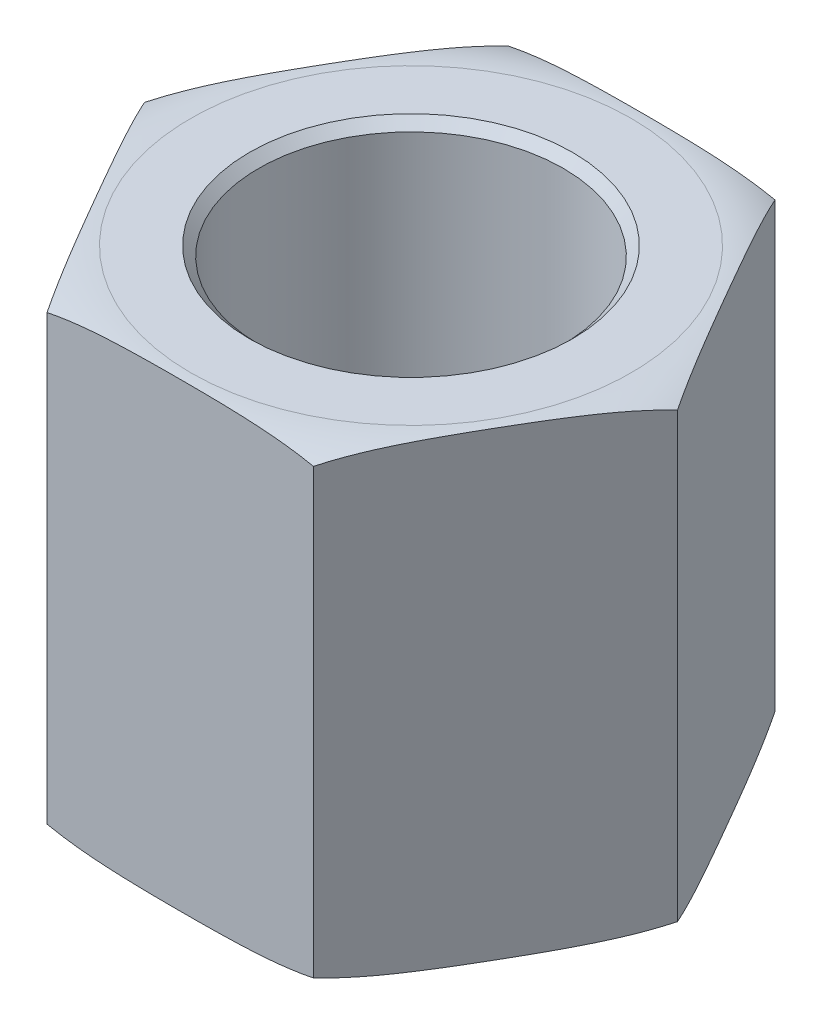
ISO-10303-21;
HEADER;
FILE_DESCRIPTION(('STEP AP214'),'2;1');
FILE_NAME('part.step','',(''),(''),'','','');
FILE_SCHEMA(('AUTOMOTIVE_DESIGN { 1 0 10303 214 1 1 1 1 }'));
ENDSEC;
DATA;
#1=APPLICATION_CONTEXT('core data for automotive mechanical design processes');
#2=APPLICATION_PROTOCOL_DEFINITION('international standard','automotive_design',2000,#1);
#3=PRODUCT_CONTEXT('',#1,'mechanical');
#4=PRODUCT('Part','Part','',(#3));
#5=PRODUCT_RELATED_PRODUCT_CATEGORY('part','',(#4));
#6=PRODUCT_DEFINITION_FORMATION('','',#4);
#7=PRODUCT_DEFINITION_CONTEXT('part definition',#1,'design');
#8=PRODUCT_DEFINITION('design','',#6,#7);
#9=PRODUCT_DEFINITION_SHAPE('','',#8);
#10=(LENGTH_UNIT() NAMED_UNIT(*) SI_UNIT(.MILLI.,.METRE.));
#11=(NAMED_UNIT(*) PLANE_ANGLE_UNIT() SI_UNIT($,.RADIAN.));
#12=(NAMED_UNIT(*) SI_UNIT($,.STERADIAN.) SOLID_ANGLE_UNIT());
#13=UNCERTAINTY_MEASURE_WITH_UNIT(LENGTH_MEASURE(1.E-05),#10,'distance_accuracy_value','');
#14=(GEOMETRIC_REPRESENTATION_CONTEXT(3) GLOBAL_UNCERTAINTY_ASSIGNED_CONTEXT((#13)) GLOBAL_UNIT_ASSIGNED_CONTEXT((#10,
#11,#12)) REPRESENTATION_CONTEXT('',''));
#15=CARTESIAN_POINT('',(0.,0.,0.));
#16=DIRECTION('',(0.,0.,1.));
#17=DIRECTION('',(1.,0.,0.));
#18=AXIS2_PLACEMENT_3D('',#15,#16,#17);
#19=CARTESIAN_POINT('',(3.66617420935412,3.175,0.));
#20=DIRECTION('',(-0.866025403784439,0.,0.5));
#21=DIRECTION('',(0.5,0.,0.866025403784439));
#22=AXIS2_PLACEMENT_3D('',#19,#20,#21);
#23=PLANE('',#22);
#24=CARTESIAN_POINT('',(3.66617420935412,3.048,0.));
#25=CARTESIAN_POINT('',(3.63753042799203,3.05993202468709,-0.0496124846400275));
#26=CARTESIAN_POINT('',(3.60875945805376,3.07055614694223,-0.0994452663561579));
#27=CARTESIAN_POINT('',(3.5510445941875,3.08952869380446,-0.199410342924434));
#28=CARTESIAN_POINT('',(3.52210079717004,3.09787829008084,-0.249542469922637));
#29=CARTESIAN_POINT('',(3.43520914920621,3.12001015084215,-0.400043218949386));
#30=CARTESIAN_POINT('',(3.37708055050429,3.13092253839952,-0.500724905273884));
#31=CARTESIAN_POINT('',(3.26070078255249,3.1475474670846,-0.702300576339481));
#32=CARTESIAN_POINT('',(3.20244972255356,3.15326351393611,-0.803194371852366));
#33=CARTESIAN_POINT('',(3.08586365366197,3.16154325238668,-1.00512736662734));
#34=CARTESIAN_POINT('',(3.02752861562773,3.1641051045623,-1.1061666163641));
#35=CARTESIAN_POINT('',(2.9113821383228,3.1674800878033,-1.30733821617637));
#36=CARTESIAN_POINT('',(2.85357078573452,3.16830898530758,-1.40747041611356));
#37=CARTESIAN_POINT('',(2.73795502274299,3.16890235146376,-1.60772279177073));
#38=CARTESIAN_POINT('',(2.68015061252641,3.16866697200316,-1.7078429671674));
#39=CARTESIAN_POINT('',(2.5645271384304,3.16693398748164,-1.90810869884931));
#40=CARTESIAN_POINT('',(2.50670807591217,3.16543597123025,-2.0082542527769));
#41=CARTESIAN_POINT('',(2.39109525560101,3.16017531674577,-2.20850153156215));
#42=CARTESIAN_POINT('',(2.33330149587797,3.15641290136093,-2.30860325976289));
#43=CARTESIAN_POINT('',(2.23849359853911,3.14698899303816,-2.47281535491257));
#44=CARTESIAN_POINT('',(2.20145192539194,3.14249057663767,-2.53697341480081));
#45=CARTESIAN_POINT('',(2.12747060706784,3.13130148199487,-2.66511281694909));
#46=CARTESIAN_POINT('',(2.09053091530161,3.12461207209161,-2.72909423990413));
#47=CARTESIAN_POINT('',(2.01669860633929,3.10839780386583,-2.85697555026699));
#48=CARTESIAN_POINT('',(1.97980639337021,3.09886525006224,-2.92087473753309));
#49=CARTESIAN_POINT('',(1.90623831426152,3.07626291445617,-3.04829838836459));
#50=CARTESIAN_POINT('',(1.86956287153406,3.06318767878213,-3.11182211855863));
#51=CARTESIAN_POINT('',(1.83308710467706,3.048,-3.175));
#52=B_SPLINE_CURVE_WITH_KNOTS('',3,(#24,#25,#26,#27,#28,#29,#30,#31,#32,#33,#34,#35,#36,#37,#38,
#39,#40,#41,#42,#43,#44,#45,#46,#47,#48,#49,#50,#51),.UNSPECIFIED.,.F.,.F.,(4,2,2,2,2,2,2,2,2,2,
2,2,2,4),(0.,0.175509467388221,0.350928353443246,0.701031261588486,1.05089779629355,
1.40096826525494,1.74783967758032,2.09466158796882,2.44159648808704,2.78849725058545,
3.01113198199941,3.23363806003512,3.45675194236246,3.68021127402553),.UNSPECIFIED.);
#53=CARTESIAN_POINT('',(3.66617420935412,3.048,0.));
#54=VERTEX_POINT('',#53);
#55=CARTESIAN_POINT('',(1.83308710467706,3.048,-3.175));
#56=VERTEX_POINT('',#55);
#57=EDGE_CURVE('E107',#54,#56,#52,.T.);
#58=ORIENTED_EDGE('',*,*,#57,.F.);
#59=DIRECTION('',(0.,1.,0.));
#60=VECTOR('',#59,1.);
#61=CARTESIAN_POINT('',(3.66617420935412,3.175,0.));
#62=LINE('',#61,#60);
#63=CARTESIAN_POINT('',(3.66617420935412,-3.048,0.));
#64=VERTEX_POINT('',#63);
#65=EDGE_CURVE('E80',#54,#64,#62,.F.);
#66=ORIENTED_EDGE('',*,*,#65,.T.);
#67=CARTESIAN_POINT('',(1.83308710467705,-3.048,-3.17500000000001));
#68=CARTESIAN_POINT('',(1.86173088603914,-3.05993202468708,-3.12538751535998));
#69=CARTESIAN_POINT('',(1.89050185597742,-3.07055614694223,-3.07555473364385));
#70=CARTESIAN_POINT('',(1.94821671984367,-3.08952869380445,-2.97558965707557));
#71=CARTESIAN_POINT('',(1.97716051686113,-3.09787829008084,-2.92545753007737));
#72=CARTESIAN_POINT('',(2.06405216482496,-3.12001015084215,-2.77495678105063));
#73=CARTESIAN_POINT('',(2.12218076352688,-3.13092253839952,-2.67427509472613));
#74=CARTESIAN_POINT('',(2.23856053147868,-3.1475474670846,-2.47269942366053));
#75=CARTESIAN_POINT('',(2.2968115914776,-3.15326351393611,-2.37180562814765));
#76=CARTESIAN_POINT('',(2.4133976603692,-3.16154325238667,-2.16987263337268));
#77=CARTESIAN_POINT('',(2.47173269840344,-3.1641051045623,-2.06883338363591));
#78=CARTESIAN_POINT('',(2.58787917570836,-3.1674800878033,-1.86766178382365));
#79=CARTESIAN_POINT('',(2.64569052829664,-3.16830898530758,-1.76752958388646));
#80=CARTESIAN_POINT('',(2.76130629128817,-3.16890235146376,-1.56727720822929));
#81=CARTESIAN_POINT('',(2.81911070150475,-3.16866697200316,-1.46715703283263));
#82=CARTESIAN_POINT('',(2.93473417560076,-3.16693398748165,-1.26689130115071));
#83=CARTESIAN_POINT('',(2.99255323811899,-3.16543597123025,-1.16674574722313));
#84=CARTESIAN_POINT('',(3.10816605843015,-3.16017531674577,-0.966498468437875));
#85=CARTESIAN_POINT('',(3.16595981815319,-3.15641290136093,-0.866396740237143));
#86=CARTESIAN_POINT('',(3.26076771549205,-3.14698899303816,-0.702184645087457));
#87=CARTESIAN_POINT('',(3.29780938863922,-3.14249057663768,-0.638026585199212));
#88=CARTESIAN_POINT('',(3.37179070696332,-3.13130148199487,-0.509887183050936));
#89=CARTESIAN_POINT('',(3.40873039872955,-3.12461207209161,-0.445905760095884));
#90=CARTESIAN_POINT('',(3.48256270769188,-3.10839780386584,-0.318024449733019));
#91=CARTESIAN_POINT('',(3.51945492066096,-3.09886525006225,-0.254125262466917));
#92=CARTESIAN_POINT('',(3.59302299976965,-3.07626291445617,-0.126701611635416));
#93=CARTESIAN_POINT('',(3.62969844249711,-3.06318767878214,-0.0631778814413746));
#94=CARTESIAN_POINT('',(3.66617420935412,-3.048,0.));
#95=B_SPLINE_CURVE_WITH_KNOTS('',3,(#67,#68,#69,#70,#71,#72,#73,#74,#75,#76,#77,#78,#79,#80,#81,
#82,#83,#84,#85,#86,#87,#88,#89,#90,#91,#92,#93,#94),.UNSPECIFIED.,.F.,.F.,(4,2,2,2,2,2,2,2,2,2,
2,2,2,4),(0.,0.175509467388219,0.350928353443241,0.701031261588478,1.05089779629354,
1.40096826525492,1.7478396775803,2.0946615879688,2.44159648808701,2.78849725058542,
3.01113198199939,3.23363806003511,3.45675194236245,3.68021127402553),.UNSPECIFIED.);
#96=CARTESIAN_POINT('',(1.83308710467705,-3.048,-3.175));
#97=VERTEX_POINT('',#96);
#98=EDGE_CURVE('E97',#97,#64,#95,.T.);
#99=ORIENTED_EDGE('',*,*,#98,.F.);
#100=DIRECTION('',(0.,1.,0.));
#101=VECTOR('',#100,1.);
#102=CARTESIAN_POINT('',(1.83308710467705,3.175,-3.175));
#103=LINE('',#102,#101);
#104=EDGE_CURVE('E111',#97,#56,#103,.T.);
#105=ORIENTED_EDGE('',*,*,#104,.T.);
#106=EDGE_LOOP('',(#58,#66,#99,#105));
#107=FACE_BOUND('',#106,.T.);
#108=ADVANCED_FACE('F17',(#107),#23,.F.);
#109=CARTESIAN_POINT('',(1.83308710467706,3.175,3.17499999999999));
#110=DIRECTION('',(-0.866025403784439,0.,-0.5));
#111=DIRECTION('',(-0.5,0.,0.866025403784439));
#112=AXIS2_PLACEMENT_3D('',#109,#110,#111);
#113=PLANE('',#112);
#114=CARTESIAN_POINT('',(1.83308710467706,3.048,3.17499999999999));
#115=CARTESIAN_POINT('',(1.86173088603915,3.05993202468709,3.12538751535996));
#116=CARTESIAN_POINT('',(1.89050185597743,3.07055614694223,3.07555473364383));
#117=CARTESIAN_POINT('',(1.94821671984368,3.08952869380446,2.97558965707556));
#118=CARTESIAN_POINT('',(1.97716051686114,3.09787829008084,2.92545753007736));
#119=CARTESIAN_POINT('',(2.06405216482498,3.12001015084215,2.77495678105061));
#120=CARTESIAN_POINT('',(2.12218076352689,3.13092253839952,2.67427509472611));
#121=CARTESIAN_POINT('',(2.23856053147869,3.1475474670846,2.47269942366051));
#122=CARTESIAN_POINT('',(2.29681159147762,3.15326351393611,2.37180562814762));
#123=CARTESIAN_POINT('',(2.41339766036922,3.16154325238668,2.16987263337265));
#124=CARTESIAN_POINT('',(2.47173269840346,3.1641051045623,2.06883338363588));
#125=CARTESIAN_POINT('',(2.58787917570838,3.1674800878033,1.86766178382361));
#126=CARTESIAN_POINT('',(2.64569052829666,3.16830898530758,1.76752958388643));
#127=CARTESIAN_POINT('',(2.76130629128819,3.16890235146376,1.56727720822926));
#128=CARTESIAN_POINT('',(2.81911070150477,3.16866697200316,1.46715703283259));
#129=CARTESIAN_POINT('',(2.93473417560078,3.16693398748164,1.26689130115067));
#130=CARTESIAN_POINT('',(2.99255323811902,3.16543597123025,1.16674574722309));
#131=CARTESIAN_POINT('',(3.10816605843018,3.16017531674577,0.966498468437834));
#132=CARTESIAN_POINT('',(3.16595981815322,3.15641290136093,0.866396740237101));
#133=CARTESIAN_POINT('',(3.26076771549208,3.14698899303816,0.702184645087417));
#134=CARTESIAN_POINT('',(3.29780938863924,3.14249057663767,0.638026585199176));
#135=CARTESIAN_POINT('',(3.37179070696334,3.13130148199487,0.509887183050908));
#136=CARTESIAN_POINT('',(3.40873039872957,3.12461207209161,0.44590576009586));
#137=CARTESIAN_POINT('',(3.48256270769189,3.10839780386583,0.318024449733003));
#138=CARTESIAN_POINT('',(3.51945492066097,3.09886525006224,0.254125262466906));
#139=CARTESIAN_POINT('',(3.59302299976965,3.07626291445617,0.126701611635412));
#140=CARTESIAN_POINT('',(3.62969844249711,3.06318767878213,0.0631778814413752));
#141=CARTESIAN_POINT('',(3.66617420935412,3.048,0.));
#142=B_SPLINE_CURVE_WITH_KNOTS('',3,(#114,#115,#116,#117,#118,#119,#120,#121,#122,#123,#124,
#125,#126,#127,#128,#129,#130,#131,#132,#133,#134,#135,#136,#137,#138,#139,#140,#141),
.UNSPECIFIED.,.F.,.F.,(4,2,2,2,2,2,2,2,2,2,2,2,2,4),(0.,0.175509467388221,0.350928353443245,
0.701031261588487,1.05089779629355,1.40096826525494,1.74783967758032,2.09466158796883,
2.44159648808704,2.78849725058546,3.01113198199941,3.23363806003511,3.45675194236244,
3.68021127402551),.UNSPECIFIED.);
#143=CARTESIAN_POINT('',(1.83308710467706,3.048,3.17499999999999));
#144=VERTEX_POINT('',#143);
#145=EDGE_CURVE('E22',#144,#54,#142,.T.);
#146=ORIENTED_EDGE('',*,*,#145,.F.);
#147=DIRECTION('',(0.,1.,0.));
#148=VECTOR('',#147,1.);
#149=CARTESIAN_POINT('',(1.83308710467706,3.175,3.17499999999999));
#150=LINE('',#149,#148);
#151=CARTESIAN_POINT('',(1.83308710467706,-3.048,3.17499999999999));
#152=VERTEX_POINT('',#151);
#153=EDGE_CURVE('E100',#144,#152,#150,.F.);
#154=ORIENTED_EDGE('',*,*,#153,.T.);
#155=CARTESIAN_POINT('',(3.66617420935412,-3.048,0.));
#156=CARTESIAN_POINT('',(3.63753042799203,-3.05993202468709,0.0496124846400327));
#157=CARTESIAN_POINT('',(3.60875945805375,-3.07055614694223,0.0994452663561634));
#158=CARTESIAN_POINT('',(3.5510445941875,-3.08952869380446,0.199410342924441));
#159=CARTESIAN_POINT('',(3.52210079717004,-3.09787829008084,0.249542469922644));
#160=CARTESIAN_POINT('',(3.4352091492062,-3.12001015084215,0.400043218949395));
#161=CARTESIAN_POINT('',(3.37708055050429,-3.13092253839952,0.500724905273894));
#162=CARTESIAN_POINT('',(3.26070078255248,-3.1475474670846,0.702300576339492));
#163=CARTESIAN_POINT('',(3.20244972255356,-3.15326351393611,0.803194371852379));
#164=CARTESIAN_POINT('',(3.08586365366196,-3.16154325238668,1.00512736662735));
#165=CARTESIAN_POINT('',(3.02752861562772,-3.1641051045623,1.10616661636412));
#166=CARTESIAN_POINT('',(2.91138213832279,-3.1674800878033,1.30733821617639));
#167=CARTESIAN_POINT('',(2.85357078573451,-3.16830898530758,1.40747041611358));
#168=CARTESIAN_POINT('',(2.73795502274298,-3.16890235146376,1.60772279177075));
#169=CARTESIAN_POINT('',(2.6801506125264,-3.16866697200316,1.70784296716742));
#170=CARTESIAN_POINT('',(2.56452713843039,-3.16693398748164,1.90810869884934));
#171=CARTESIAN_POINT('',(2.50670807591215,-3.16543597123025,2.00825425277692));
#172=CARTESIAN_POINT('',(2.39109525560099,-3.16017531674577,2.20850153156218));
#173=CARTESIAN_POINT('',(2.33330149587795,-3.15641290136093,2.30860325976292));
#174=CARTESIAN_POINT('',(2.23849359853909,-3.14698899303816,2.4728153549126));
#175=CARTESIAN_POINT('',(2.20145192539193,-3.14249057663767,2.53697341480084));
#176=CARTESIAN_POINT('',(2.12747060706783,-3.13130148199487,2.6651128169491));
#177=CARTESIAN_POINT('',(2.0905309153016,-3.1246120720916,2.72909423990415));
#178=CARTESIAN_POINT('',(2.01669860633929,-3.10839780386583,2.856975550267));
#179=CARTESIAN_POINT('',(1.97980639337021,-3.09886525006224,2.9208747375331));
#180=CARTESIAN_POINT('',(1.90623831426152,-3.07626291445617,3.04829838836459));
#181=CARTESIAN_POINT('',(1.86956287153407,-3.06318767878213,3.11182211855862));
#182=CARTESIAN_POINT('',(1.83308710467706,-3.048,3.17499999999999));
#183=B_SPLINE_CURVE_WITH_KNOTS('',3,(#155,#156,#157,#158,#159,#160,#161,#162,#163,#164,#165,
#166,#167,#168,#169,#170,#171,#172,#173,#174,#175,#176,#177,#178,#179,#180,#181,#182),
.UNSPECIFIED.,.F.,.F.,(4,2,2,2,2,2,2,2,2,2,2,2,2,4),(0.,0.175509467388222,0.350928353443248,
0.701031261588493,1.05089779629356,1.40096826525495,1.74783967758034,2.09466158796885,
2.44159648808707,2.78849725058548,3.01113198199943,3.23363806003512,3.45675194236245,
3.68021127402551),.UNSPECIFIED.);
#184=EDGE_CURVE('E205',#64,#152,#183,.T.);
#185=ORIENTED_EDGE('',*,*,#184,.F.);
#186=ORIENTED_EDGE('',*,*,#65,.F.);
#187=EDGE_LOOP('',(#146,#154,#185,#186));
#188=FACE_BOUND('',#187,.T.);
#189=ADVANCED_FACE('F106',(#188),#113,.F.);
#190=CARTESIAN_POINT('',(-1.83308710467707,3.175,3.175));
#191=DIRECTION('',(0.,0.,-1.));
#192=DIRECTION('',(-1.,0.,0.));
#193=AXIS2_PLACEMENT_3D('',#190,#191,#192);
#194=PLANE('',#193);
#195=ORIENTED_EDGE('',*,*,#153,.F.);
#196=CARTESIAN_POINT('',(-1.83308710467707,3.048,3.175));
#197=CARTESIAN_POINT('',(-1.75760871054776,3.06371230122365,3.175));
#198=CARTESIAN_POINT('',(-1.68170571468658,3.0771647800808,3.175));
#199=CARTESIAN_POINT('',(-1.52939807527773,3.10030486470105,3.175));
#200=CARTESIAN_POINT('',(-1.45299400110163,3.10999617502722,3.175));
#201=CARTESIAN_POINT('',(-1.30011823209764,3.12637135267139,3.175));
#202=CARTESIAN_POINT('',(-1.22364747610196,3.13306442247852,3.175));
#203=CARTESIAN_POINT('',(-1.07052459410173,3.14417241699752,3.175));
#204=CARTESIAN_POINT('',(-0.993872424115957,3.14858671655425,3.175));
#205=CARTESIAN_POINT('',(-0.840856910195846,3.15572419802799,3.175));
#206=CARTESIAN_POINT('',(-0.764493913329282,3.15845527367792,3.175));
#207=CARTESIAN_POINT('',(-0.611734616938516,3.16275632258003,3.175));
#208=CARTESIAN_POINT('',(-0.535338316331409,3.16432625473883,3.175));
#209=CARTESIAN_POINT('',(-0.38245423122642,3.16668247076568,3.175));
#210=CARTESIAN_POINT('',(-0.305966435115039,3.16746792759644,3.175));
#211=CARTESIAN_POINT('',(-0.152985759387013,3.16848841069005,3.175));
#212=CARTESIAN_POINT('',(-0.0764928796935065,3.16872342414921,3.175));
#213=CARTESIAN_POINT('',(0.0764928796935058,3.16872342414921,3.175));
#214=CARTESIAN_POINT('',(0.152985759387012,3.16848841069005,3.17499999999999));
#215=CARTESIAN_POINT('',(0.305966435115038,3.16746792759644,3.17499999999999));
#216=CARTESIAN_POINT('',(0.382454231226419,3.16668247076568,3.17499999999999));
#217=CARTESIAN_POINT('',(0.535338316331408,3.16432625473883,3.17499999999999));
#218=CARTESIAN_POINT('',(0.611734616938514,3.16275632258003,3.17499999999999));
#219=CARTESIAN_POINT('',(0.76449391332928,3.15845527367792,3.17499999999999));
#220=CARTESIAN_POINT('',(0.840856910195844,3.15572419802799,3.17499999999999));
#221=CARTESIAN_POINT('',(0.993872424115954,3.14858671655425,3.17499999999999));
#222=CARTESIAN_POINT('',(1.07052459410172,3.14417241699752,3.17499999999999));
#223=CARTESIAN_POINT('',(1.22364747610196,3.13306442247852,3.17499999999999));
#224=CARTESIAN_POINT('',(1.30011823209763,3.12637135267139,3.17499999999999));
#225=CARTESIAN_POINT('',(1.45299400110163,3.10999617502722,3.17499999999999));
#226=CARTESIAN_POINT('',(1.52939807527773,3.10030486470105,3.17499999999999));
#227=CARTESIAN_POINT('',(1.68170571468658,3.07716478008081,3.17499999999999));
#228=CARTESIAN_POINT('',(1.75760871054776,3.06371230122365,3.17499999999999));
#229=CARTESIAN_POINT('',(1.83308710467706,3.048,3.17499999999999));
#230=B_SPLINE_CURVE_WITH_KNOTS('',3,(#196,#197,#198,#199,#200,#201,#202,#203,#204,#205,#206,
#207,#208,#209,#210,#211,#212,#213,#214,#215,#216,#217,#218,#219,#220,#221,#222,#223,#224,#225,
#226,#227,#228,#229),.UNSPECIFIED.,.F.,.F.,(4,2,2,2,2,2,2,2,2,2,2,2,2,2,2,2,4),(0.,
0.23119079437731,0.46215329593589,0.692401964780504,0.922713766248053,1.15193709952408,
1.3811685447265,1.61064140410055,1.84011960111017,2.06959779811978,2.29907065749383,
2.52830210269625,2.75752543597228,2.98783723743982,3.21808590628444,3.44904840784302,
3.68023920222033),.UNSPECIFIED.);
#231=CARTESIAN_POINT('',(-1.83308710467707,3.048,3.175));
#232=VERTEX_POINT('',#231);
#233=EDGE_CURVE('E86',#232,#144,#230,.T.);
#234=ORIENTED_EDGE('',*,*,#233,.F.);
#235=DIRECTION('',(0.,1.,0.));
#236=VECTOR('',#235,1.);
#237=CARTESIAN_POINT('',(-1.83308710467707,3.175,3.175));
#238=LINE('',#237,#236);
#239=CARTESIAN_POINT('',(-1.83308710467707,-3.048,3.175));
#240=VERTEX_POINT('',#239);
#241=EDGE_CURVE('E104',#232,#240,#238,.F.);
#242=ORIENTED_EDGE('',*,*,#241,.T.);
#243=CARTESIAN_POINT('',(1.83308710467706,-3.048,3.17499999999999));
#244=CARTESIAN_POINT('',(1.75760871054776,-3.06371230122365,3.17499999999999));
#245=CARTESIAN_POINT('',(1.68170571468658,-3.07716478008081,3.17499999999999));
#246=CARTESIAN_POINT('',(1.52939807527773,-3.10030486470105,3.17499999999999));
#247=CARTESIAN_POINT('',(1.45299400110163,-3.10999617502722,3.17499999999999));
#248=CARTESIAN_POINT('',(1.30011823209763,-3.12637135267139,3.17499999999999));
#249=CARTESIAN_POINT('',(1.22364747610196,-3.13306442247852,3.17499999999999));
#250=CARTESIAN_POINT('',(1.07052459410172,-3.14417241699752,3.17499999999999));
#251=CARTESIAN_POINT('',(0.993872424115954,-3.14858671655425,3.17499999999999));
#252=CARTESIAN_POINT('',(0.840856910195844,-3.15572419802799,3.17499999999999));
#253=CARTESIAN_POINT('',(0.76449391332928,-3.15845527367792,3.17499999999999));
#254=CARTESIAN_POINT('',(0.611734616938515,-3.16275632258003,3.17499999999999));
#255=CARTESIAN_POINT('',(0.535338316331408,-3.16432625473883,3.17499999999999));
#256=CARTESIAN_POINT('',(0.382454231226419,-3.16668247076568,3.17499999999999));
#257=CARTESIAN_POINT('',(0.305966435115038,-3.16746792759644,3.17499999999999));
#258=CARTESIAN_POINT('',(0.152985759387012,-3.16848841069005,3.17499999999999));
#259=CARTESIAN_POINT('',(0.0764928796935062,-3.16872342414921,3.175));
#260=CARTESIAN_POINT('',(-0.076492879693506,-3.16872342414921,3.175));
#261=CARTESIAN_POINT('',(-0.152985759387012,-3.16848841069005,3.175));
#262=CARTESIAN_POINT('',(-0.305966435115038,-3.16746792759644,3.175));
#263=CARTESIAN_POINT('',(-0.382454231226419,-3.16668247076568,3.175));
#264=CARTESIAN_POINT('',(-0.535338316331408,-3.16432625473883,3.175));
#265=CARTESIAN_POINT('',(-0.611734616938515,-3.16275632258003,3.175));
#266=CARTESIAN_POINT('',(-0.76449391332928,-3.15845527367792,3.175));
#267=CARTESIAN_POINT('',(-0.840856910195844,-3.15572419802798,3.175));
#268=CARTESIAN_POINT('',(-0.993872424115954,-3.14858671655425,3.175));
#269=CARTESIAN_POINT('',(-1.07052459410172,-3.14417241699752,3.175));
#270=CARTESIAN_POINT('',(-1.22364747610196,-3.13306442247852,3.175));
#271=CARTESIAN_POINT('',(-1.30011823209763,-3.12637135267139,3.175));
#272=CARTESIAN_POINT('',(-1.45299400110163,-3.10999617502722,3.175));
#273=CARTESIAN_POINT('',(-1.52939807527773,-3.10030486470105,3.175));
#274=CARTESIAN_POINT('',(-1.68170571468658,-3.07716478008081,3.175));
#275=CARTESIAN_POINT('',(-1.75760871054776,-3.06371230122365,3.175));
#276=CARTESIAN_POINT('',(-1.83308710467706,-3.048,3.175));
#277=B_SPLINE_CURVE_WITH_KNOTS('',3,(#243,#244,#245,#246,#247,#248,#249,#250,#251,#252,#253,
#254,#255,#256,#257,#258,#259,#260,#261,#262,#263,#264,#265,#266,#267,#268,#269,#270,#271,#272,
#273,#274,#275,#276),.UNSPECIFIED.,.F.,.F.,(4,2,2,2,2,2,2,2,2,2,2,2,2,2,2,2,4),(0.,
0.231190794377309,0.462153295935889,0.692401964780502,0.92271376624805,1.15193709952407,
1.3811685447265,1.61064140410055,1.84011960111016,2.06959779811977,2.29907065749383,
2.52830210269625,2.75752543597227,2.98783723743982,3.21808590628443,3.44904840784301,
3.68023920222032),.UNSPECIFIED.);
#278=EDGE_CURVE('E102',#152,#240,#277,.T.);
#279=ORIENTED_EDGE('',*,*,#278,.F.);
#280=EDGE_LOOP('',(#195,#234,#242,#279));
#281=FACE_BOUND('',#280,.T.);
#282=ADVANCED_FACE('F101',(#281),#194,.F.);
#283=CARTESIAN_POINT('',(-3.66617420935413,3.175,0.));
#284=DIRECTION('',(0.866025403784439,0.,-0.499999999999999));
#285=DIRECTION('',(-0.499999999999999,0.,-0.866025403784439));
#286=AXIS2_PLACEMENT_3D('',#283,#284,#285);
#287=PLANE('',#286);
#288=CARTESIAN_POINT('',(-3.66617420935412,3.048,0.));
#289=CARTESIAN_POINT('',(-3.63753042799204,3.05993202468708,0.0496124846400254));
#290=CARTESIAN_POINT('',(-3.60875945805376,3.07055614694223,0.0994452663561539));
#291=CARTESIAN_POINT('',(-3.55104459418751,3.08952869380445,0.199410342924427));
#292=CARTESIAN_POINT('',(-3.52210079717005,3.09787829008083,0.249542469922628));
#293=CARTESIAN_POINT('',(-3.43520914920622,3.12001015084215,0.400043218949372));
#294=CARTESIAN_POINT('',(-3.37708055050431,3.13092253839952,0.500724905273867));
#295=CARTESIAN_POINT('',(-3.26070078255251,3.1475474670846,0.702300576339457));
#296=CARTESIAN_POINT('',(-3.20244972255358,3.15326351393611,0.803194371852339));
#297=CARTESIAN_POINT('',(-3.08586365366199,3.16154325238667,1.0051273666273));
#298=CARTESIAN_POINT('',(-3.02752861562775,3.1641051045623,1.10616661636407));
#299=CARTESIAN_POINT('',(-2.91138213832284,3.1674800878033,1.30733821617633));
#300=CARTESIAN_POINT('',(-2.85357078573456,3.16830898530758,1.40747041611351));
#301=CARTESIAN_POINT('',(-2.73795502274303,3.16890235146376,1.60772279177068));
#302=CARTESIAN_POINT('',(-2.68015061252645,3.16866697200316,1.70784296716734));
#303=CARTESIAN_POINT('',(-2.56452713843045,3.16693398748165,1.90810869884925));
#304=CARTESIAN_POINT('',(-2.50670807591221,3.16543597123025,2.00825425277683));
#305=CARTESIAN_POINT('',(-2.39109525560106,3.16017531674577,2.20850153156208));
#306=CARTESIAN_POINT('',(-2.33330149587802,3.15641290136093,2.30860325976281));
#307=CARTESIAN_POINT('',(-2.23849359853916,3.14698899303816,2.4728153549125));
#308=CARTESIAN_POINT('',(-2.20145192539199,3.14249057663768,2.53697341480075));
#309=CARTESIAN_POINT('',(-2.12747060706788,3.13130148199487,2.66511281694903));
#310=CARTESIAN_POINT('',(-2.09053091530165,3.12461207209161,2.72909423990409));
#311=CARTESIAN_POINT('',(-2.01669860633932,3.10839780386584,2.85697555026696));
#312=CARTESIAN_POINT('',(-1.97980639337024,3.09886525006225,2.92087473753306));
#313=CARTESIAN_POINT('',(-1.90623831426154,3.07626291445617,3.04829838836457));
#314=CARTESIAN_POINT('',(-1.86956287153408,3.06318767878213,3.11182211855862));
#315=CARTESIAN_POINT('',(-1.83308710467707,3.048,3.175));
#316=B_SPLINE_CURVE_WITH_KNOTS('',3,(#288,#289,#290,#291,#292,#293,#294,#295,#296,#297,#298,
#299,#300,#301,#302,#303,#304,#305,#306,#307,#308,#309,#310,#311,#312,#313,#314,#315),
.UNSPECIFIED.,.F.,.F.,(4,2,2,2,2,2,2,2,2,2,2,2,2,4),(0.,0.175509467388214,0.350928353443233,
0.701031261588463,1.05089779629351,1.40096826525489,1.74783967758026,2.09466158796875,
2.44159648808696,2.78849725058536,3.01113198199934,3.23363806003507,3.45675194236243,
3.68021127402552),.UNSPECIFIED.);
#317=CARTESIAN_POINT('',(-3.66617420935413,3.048,0.));
#318=VERTEX_POINT('',#317);
#319=EDGE_CURVE('E94',#318,#232,#316,.T.);
#320=ORIENTED_EDGE('',*,*,#319,.F.);
#321=DIRECTION('',(0.,1.,0.));
#322=VECTOR('',#321,1.);
#323=CARTESIAN_POINT('',(-3.66617420935413,3.175,0.));
#324=LINE('',#323,#322);
#325=CARTESIAN_POINT('',(-3.66617420935413,-3.048,0.));
#326=VERTEX_POINT('',#325);
#327=EDGE_CURVE('E118',#318,#326,#324,.F.);
#328=ORIENTED_EDGE('',*,*,#327,.T.);
#329=CARTESIAN_POINT('',(-1.83308710467707,-3.048,3.175));
#330=CARTESIAN_POINT('',(-1.86173088603915,-3.05993202468708,3.12538751535997));
#331=CARTESIAN_POINT('',(-1.89050185597743,-3.07055614694223,3.07555473364384));
#332=CARTESIAN_POINT('',(-1.94821671984368,-3.08952869380445,2.97558965707557));
#333=CARTESIAN_POINT('',(-1.97716051686114,-3.09787829008083,2.92545753007737));
#334=CARTESIAN_POINT('',(-2.06405216482497,-3.12001015084215,2.77495678105062));
#335=CARTESIAN_POINT('',(-2.12218076352689,-3.13092253839952,2.67427509472613));
#336=CARTESIAN_POINT('',(-2.23856053147869,-3.1475474670846,2.47269942366054));
#337=CARTESIAN_POINT('',(-2.29681159147761,-3.15326351393611,2.37180562814765));
#338=CARTESIAN_POINT('',(-2.4133976603692,-3.16154325238667,2.16987263337269));
#339=CARTESIAN_POINT('',(-2.47173269840344,-3.1641051045623,2.06883338363592));
#340=CARTESIAN_POINT('',(-2.58787917570836,-3.1674800878033,1.86766178382366));
#341=CARTESIAN_POINT('',(-2.64569052829664,-3.16830898530758,1.76752958388648));
#342=CARTESIAN_POINT('',(-2.76130629128817,-3.16890235146376,1.56727720822931));
#343=CARTESIAN_POINT('',(-2.81911070150475,-3.16866697200316,1.46715703283264));
#344=CARTESIAN_POINT('',(-2.93473417560076,-3.16693398748165,1.26689130115073));
#345=CARTESIAN_POINT('',(-2.99255323811899,-3.16543597123025,1.16674574722315));
#346=CARTESIAN_POINT('',(-3.10816605843014,-3.16017531674577,0.966498468437898));
#347=CARTESIAN_POINT('',(-3.16595981815318,-3.15641290136093,0.866396740237167));
#348=CARTESIAN_POINT('',(-3.26076771549205,-3.14698899303816,0.70218464508748));
#349=CARTESIAN_POINT('',(-3.29780938863921,-3.14249057663768,0.638026585199233));
#350=CARTESIAN_POINT('',(-3.37179070696332,-3.13130148199487,0.509887183050953));
#351=CARTESIAN_POINT('',(-3.40873039872955,-3.12461207209161,0.4459057600959));
#352=CARTESIAN_POINT('',(-3.48256270769188,-3.10839780386584,0.31802444973303));
#353=CARTESIAN_POINT('',(-3.51945492066096,-3.09886525006224,0.254125262466927));
#354=CARTESIAN_POINT('',(-3.59302299976965,-3.07626291445617,0.126701611635421));
#355=CARTESIAN_POINT('',(-3.62969844249711,-3.06318767878213,0.0631778814413779));
#356=CARTESIAN_POINT('',(-3.66617420935412,-3.048,0.));
#357=B_SPLINE_CURVE_WITH_KNOTS('',3,(#329,#330,#331,#332,#333,#334,#335,#336,#337,#338,#339,
#340,#341,#342,#343,#344,#345,#346,#347,#348,#349,#350,#351,#352,#353,#354,#355,#356),
.UNSPECIFIED.,.F.,.F.,(4,2,2,2,2,2,2,2,2,2,2,2,2,4),(0.,0.175509467388216,0.350928353443237,
0.701031261588469,1.05089779629352,1.4009682652549,1.74783967758028,2.09466158796877,
2.44159648808698,2.78849725058538,3.01113198199935,3.23363806003508,3.45675194236243,
3.68021127402552),.UNSPECIFIED.);
#358=EDGE_CURVE('E196',#240,#326,#357,.T.);
#359=ORIENTED_EDGE('',*,*,#358,.F.);
#360=ORIENTED_EDGE('',*,*,#241,.F.);
#361=EDGE_LOOP('',(#320,#328,#359,#360));
#362=FACE_BOUND('',#361,.T.);
#363=ADVANCED_FACE('F190',(#362),#287,.F.);
#364=CARTESIAN_POINT('',(-1.83308710467707,3.175,-3.175));
#365=DIRECTION('',(0.866025403784439,0.,0.5));
#366=DIRECTION('',(0.5,0.,-0.866025403784439));
#367=AXIS2_PLACEMENT_3D('',#364,#365,#366);
#368=PLANE('',#367);
#369=CARTESIAN_POINT('',(-1.83308710467706,3.04799999999999,-3.17500000000001));
#370=CARTESIAN_POINT('',(-1.86173088603915,3.05993202468708,-3.12538751535998));
#371=CARTESIAN_POINT('',(-1.89050185597742,3.07055614694222,-3.07555473364385));
#372=CARTESIAN_POINT('',(-1.94821671984368,3.08952869380445,-2.97558965707558));
#373=CARTESIAN_POINT('',(-1.97716051686114,3.09787829008083,-2.92545753007738));
#374=CARTESIAN_POINT('',(-2.06405216482497,3.12001015084215,-2.77495678105064));
#375=CARTESIAN_POINT('',(-2.12218076352688,3.13092253839952,-2.67427509472615));
#376=CARTESIAN_POINT('',(-2.23856053147867,3.1475474670846,-2.47269942366056));
#377=CARTESIAN_POINT('',(-2.2968115914776,3.15326351393611,-2.37180562814768));
#378=CARTESIAN_POINT('',(-2.41339766036919,3.16154325238667,-2.16987263337272));
#379=CARTESIAN_POINT('',(-2.47173269840343,3.1641051045623,-2.06883338363596));
#380=CARTESIAN_POINT('',(-2.58787917570834,3.1674800878033,-1.8676617838237));
#381=CARTESIAN_POINT('',(-2.64569052829662,3.16830898530758,-1.76752958388652));
#382=CARTESIAN_POINT('',(-2.76130629128815,3.16890235146376,-1.56727720822935));
#383=CARTESIAN_POINT('',(-2.81911070150472,3.16866697200316,-1.46715703283269));
#384=CARTESIAN_POINT('',(-2.93473417560073,3.16693398748165,-1.26689130115079));
#385=CARTESIAN_POINT('',(-2.99255323811896,3.16543597123025,-1.16674574722321));
#386=CARTESIAN_POINT('',(-3.10816605843011,3.16017531674577,-0.966498468437962));
#387=CARTESIAN_POINT('',(-3.16595981815315,3.15641290136093,-0.866396740237233));
#388=CARTESIAN_POINT('',(-3.26076771549201,3.14698899303817,-0.702184645087543));
#389=CARTESIAN_POINT('',(-3.29780938863918,3.14249057663768,-0.638026585199291));
#390=CARTESIAN_POINT('',(-3.37179070696329,3.13130148199488,-0.509887183050999));
#391=CARTESIAN_POINT('',(-3.40873039872953,3.12461207209161,-0.445905760095941));
#392=CARTESIAN_POINT('',(-3.48256270769186,3.10839780386584,-0.31802444973306));
#393=CARTESIAN_POINT('',(-3.51945492066095,3.09886525006225,-0.254125262466951));
#394=CARTESIAN_POINT('',(-3.59302299976965,3.07626291445617,-0.126701611635435));
#395=CARTESIAN_POINT('',(-3.62969844249711,3.06318767878213,-0.0631778814413863));
#396=CARTESIAN_POINT('',(-3.66617420935413,3.048,0.));
#397=B_SPLINE_CURVE_WITH_KNOTS('',3,(#369,#370,#371,#372,#373,#374,#375,#376,#377,#378,#379,
#380,#381,#382,#383,#384,#385,#386,#387,#388,#389,#390,#391,#392,#393,#394,#395,#396),
.UNSPECIFIED.,.F.,.F.,(4,2,2,2,2,2,2,2,2,2,2,2,2,4),(0.,0.175509467388212,0.350928353443228,
0.701031261588453,1.0508977962935,1.40096826525487,1.74783967758024,2.09466158796872,
2.44159648808692,2.78849725058532,3.01113198199931,3.23363806003505,3.45675194236242,
3.68021127402553),.UNSPECIFIED.);
#398=CARTESIAN_POINT('',(-1.83308710467706,3.048,-3.175));
#399=VERTEX_POINT('',#398);
#400=EDGE_CURVE('E166',#399,#318,#397,.T.);
#401=ORIENTED_EDGE('',*,*,#400,.F.);
#402=DIRECTION('',(0.,1.,0.));
#403=VECTOR('',#402,1.);
#404=CARTESIAN_POINT('',(-1.83308710467706,3.175,-3.175));
#405=LINE('',#404,#403);
#406=CARTESIAN_POINT('',(-1.83308710467707,-3.048,-3.175));
#407=VERTEX_POINT('',#406);
#408=EDGE_CURVE('E108',#399,#407,#405,.F.);
#409=ORIENTED_EDGE('',*,*,#408,.T.);
#410=CARTESIAN_POINT('',(-3.66617420935413,-3.048,0.));
#411=CARTESIAN_POINT('',(-3.63753042799204,-3.05993202468708,-0.0496124846400307));
#412=CARTESIAN_POINT('',(-3.60875945805377,-3.07055614694223,-0.0994452663561598));
#413=CARTESIAN_POINT('',(-3.55104459418751,-3.08952869380445,-0.199410342924434));
#414=CARTESIAN_POINT('',(-3.52210079717005,-3.09787829008083,-0.249542469922635));
#415=CARTESIAN_POINT('',(-3.43520914920622,-3.12001015084215,-0.400043218949381));
#416=CARTESIAN_POINT('',(-3.37708055050431,-3.13092253839952,-0.500724905273877));
#417=CARTESIAN_POINT('',(-3.26070078255251,-3.1475474670846,-0.702300576339469));
#418=CARTESIAN_POINT('',(-3.20244972255358,-3.15326351393611,-0.803194371852352));
#419=CARTESIAN_POINT('',(-3.08586365366199,-3.16154325238667,-1.00512736662732));
#420=CARTESIAN_POINT('',(-3.02752861562775,-3.1641051045623,-1.10616661636408));
#421=CARTESIAN_POINT('',(-2.91138213832283,-3.1674800878033,-1.30733821617635));
#422=CARTESIAN_POINT('',(-2.85357078573455,-3.16830898530758,-1.40747041611353));
#423=CARTESIAN_POINT('',(-2.73795502274302,-3.16890235146376,-1.6077227917707));
#424=CARTESIAN_POINT('',(-2.68015061252644,-3.16866697200316,-1.70784296716736));
#425=CARTESIAN_POINT('',(-2.56452713843043,-3.16693398748165,-1.90810869884928));
#426=CARTESIAN_POINT('',(-2.5067080759122,-3.16543597123025,-2.00825425277686));
#427=CARTESIAN_POINT('',(-2.39109525560105,-3.16017531674577,-2.20850153156211));
#428=CARTESIAN_POINT('',(-2.33330149587801,-3.15641290136093,-2.30860325976284));
#429=CARTESIAN_POINT('',(-2.23849359853914,-3.14698899303816,-2.47281535491253));
#430=CARTESIAN_POINT('',(-2.20145192539198,-3.14249057663768,-2.53697341480077));
#431=CARTESIAN_POINT('',(-2.12747060706787,-3.13130148199487,-2.66511281694905));
#432=CARTESIAN_POINT('',(-2.09053091530164,-3.12461207209161,-2.72909423990411));
#433=CARTESIAN_POINT('',(-2.01669860633931,-3.10839780386583,-2.85697555026697));
#434=CARTESIAN_POINT('',(-1.97980639337023,-3.09886525006224,-2.92087473753308));
#435=CARTESIAN_POINT('',(-1.90623831426154,-3.07626291445617,-3.04829838836458));
#436=CARTESIAN_POINT('',(-1.86956287153408,-3.06318767878213,-3.11182211855862));
#437=CARTESIAN_POINT('',(-1.83308710467707,-3.04799999999999,-3.175));
#438=B_SPLINE_CURVE_WITH_KNOTS('',3,(#410,#411,#412,#413,#414,#415,#416,#417,#418,#419,#420,
#421,#422,#423,#424,#425,#426,#427,#428,#429,#430,#431,#432,#433,#434,#435,#436,#437),
.UNSPECIFIED.,.F.,.F.,(4,2,2,2,2,2,2,2,2,2,2,2,2,4),(0.,0.175509467388217,0.350928353443237,
0.701031261588471,1.05089779629352,1.4009682652549,1.74783967758028,2.09466158796878,
2.44159648808699,2.78849725058539,3.01113198199936,3.23363806003508,3.45675194236244,
3.68021127402552),.UNSPECIFIED.);
#439=EDGE_CURVE('E142',#326,#407,#438,.T.);
#440=ORIENTED_EDGE('',*,*,#439,.F.);
#441=ORIENTED_EDGE('',*,*,#327,.F.);
#442=EDGE_LOOP('',(#401,#409,#440,#441));
#443=FACE_BOUND('',#442,.T.);
#444=ADVANCED_FACE('F152',(#443),#368,.F.);
#445=CARTESIAN_POINT('',(1.83308710467706,3.175,-3.175));
#446=DIRECTION('',(0.,0.,1.));
#447=DIRECTION('',(1.,0.,0.));
#448=AXIS2_PLACEMENT_3D('',#445,#446,#447);
#449=PLANE('',#448);
#450=CARTESIAN_POINT('',(1.83308710467706,3.048,-3.175));
#451=CARTESIAN_POINT('',(1.75760871054775,3.06371230122365,-3.175));
#452=CARTESIAN_POINT('',(1.68170571468657,3.0771647800808,-3.175));
#453=CARTESIAN_POINT('',(1.52939807527772,3.10030486470105,-3.175));
#454=CARTESIAN_POINT('',(1.45299400110163,3.10999617502722,-3.175));
#455=CARTESIAN_POINT('',(1.30011823209763,3.12637135267138,-3.175));
#456=CARTESIAN_POINT('',(1.22364747610195,3.13306442247852,-3.175));
#457=CARTESIAN_POINT('',(1.07052459410172,3.14417241699752,-3.175));
#458=CARTESIAN_POINT('',(0.99387242411595,3.14858671655425,-3.175));
#459=CARTESIAN_POINT('',(0.840856910195841,3.15572419802798,-3.175));
#460=CARTESIAN_POINT('',(0.764493913329277,3.15845527367792,-3.175));
#461=CARTESIAN_POINT('',(0.611734616938512,3.16275632258003,-3.175));
#462=CARTESIAN_POINT('',(0.535338316331406,3.16432625473883,-3.175));
#463=CARTESIAN_POINT('',(0.382454231226418,3.16668247076568,-3.175));
#464=CARTESIAN_POINT('',(0.305966435115037,3.16746792759644,-3.175));
#465=CARTESIAN_POINT('',(0.152985759387012,3.16848841069004,-3.175));
#466=CARTESIAN_POINT('',(0.0764928796935061,3.16872342414921,-3.175));
#467=CARTESIAN_POINT('',(-0.0764928796935054,3.16872342414921,-3.175));
#468=CARTESIAN_POINT('',(-0.152985759387011,3.16848841069004,-3.175));
#469=CARTESIAN_POINT('',(-0.305966435115037,3.16746792759644,-3.175));
#470=CARTESIAN_POINT('',(-0.382454231226417,3.16668247076568,-3.175));
#471=CARTESIAN_POINT('',(-0.535338316331406,3.16432625473883,-3.175));
#472=CARTESIAN_POINT('',(-0.611734616938512,3.16275632258003,-3.175));
#473=CARTESIAN_POINT('',(-0.764493913329277,3.15845527367792,-3.175));
#474=CARTESIAN_POINT('',(-0.84085691019584,3.15572419802798,-3.175));
#475=CARTESIAN_POINT('',(-0.99387242411595,3.14858671655425,-3.175));
#476=CARTESIAN_POINT('',(-1.07052459410172,3.14417241699752,-3.175));
#477=CARTESIAN_POINT('',(-1.22364747610195,3.13306442247852,-3.175));
#478=CARTESIAN_POINT('',(-1.30011823209763,3.12637135267138,-3.175));
#479=CARTESIAN_POINT('',(-1.45299400110163,3.10999617502722,-3.175));
#480=CARTESIAN_POINT('',(-1.52939807527772,3.10030486470105,-3.175));
#481=CARTESIAN_POINT('',(-1.68170571468657,3.0771647800808,-3.175));
#482=CARTESIAN_POINT('',(-1.75760871054775,3.06371230122365,-3.175));
#483=CARTESIAN_POINT('',(-1.83308710467706,3.048,-3.175));
#484=B_SPLINE_CURVE_WITH_KNOTS('',3,(#450,#451,#452,#453,#454,#455,#456,#457,#458,#459,#460,
#461,#462,#463,#464,#465,#466,#467,#468,#469,#470,#471,#472,#473,#474,#475,#476,#477,#478,#479,
#480,#481,#482,#483),.UNSPECIFIED.,.F.,.F.,(4,2,2,2,2,2,2,2,2,2,2,2,2,2,2,2,4),(0.,
0.231190794377309,0.462153295935887,0.6924019647805,0.922713766248047,1.15193709952407,
1.38116854472649,1.61064140410054,1.84011960111015,2.06959779811976,2.29907065749382,
2.52830210269624,2.75752543597226,2.98783723743981,3.21808590628442,3.449048407843,
3.68023920222031),.UNSPECIFIED.);
#485=EDGE_CURVE('E109',#56,#399,#484,.T.);
#486=ORIENTED_EDGE('',*,*,#485,.F.);
#487=ORIENTED_EDGE('',*,*,#104,.F.);
#488=CARTESIAN_POINT('',(-1.83308710467707,-3.04799999999999,-3.175));
#489=CARTESIAN_POINT('',(-1.75760871054776,-3.06371230122365,-3.175));
#490=CARTESIAN_POINT('',(-1.68170571468658,-3.0771647800808,-3.175));
#491=CARTESIAN_POINT('',(-1.52939807527773,-3.10030486470104,-3.175));
#492=CARTESIAN_POINT('',(-1.45299400110163,-3.10999617502722,-3.175));
#493=CARTESIAN_POINT('',(-1.30011823209763,-3.12637135267138,-3.175));
#494=CARTESIAN_POINT('',(-1.22364747610196,-3.13306442247852,-3.175));
#495=CARTESIAN_POINT('',(-1.07052459410173,-3.14417241699752,-3.175));
#496=CARTESIAN_POINT('',(-0.993872424115955,-3.14858671655425,-3.175));
#497=CARTESIAN_POINT('',(-0.840856910195845,-3.15572419802798,-3.175));
#498=CARTESIAN_POINT('',(-0.764493913329281,-3.15845527367792,-3.175));
#499=CARTESIAN_POINT('',(-0.611734616938515,-3.16275632258003,-3.175));
#500=CARTESIAN_POINT('',(-0.535338316331409,-3.16432625473883,-3.175));
#501=CARTESIAN_POINT('',(-0.38245423122642,-3.16668247076568,-3.175));
#502=CARTESIAN_POINT('',(-0.305966435115039,-3.16746792759644,-3.175));
#503=CARTESIAN_POINT('',(-0.152985759387013,-3.16848841069004,-3.175));
#504=CARTESIAN_POINT('',(-0.0764928796935065,-3.16872342414921,-3.175));
#505=CARTESIAN_POINT('',(0.0764928796935051,-3.16872342414921,-3.175));
#506=CARTESIAN_POINT('',(0.152985759387011,-3.16848841069004,-3.175));
#507=CARTESIAN_POINT('',(0.305966435115035,-3.16746792759644,-3.175));
#508=CARTESIAN_POINT('',(0.382454231226415,-3.16668247076568,-3.175));
#509=CARTESIAN_POINT('',(0.535338316331403,-3.16432625473883,-3.175));
#510=CARTESIAN_POINT('',(0.611734616938509,-3.16275632258003,-3.175));
#511=CARTESIAN_POINT('',(0.764493913329273,-3.15845527367792,-3.175));
#512=CARTESIAN_POINT('',(0.840856910195836,-3.15572419802798,-3.175));
#513=CARTESIAN_POINT('',(0.993872424115945,-3.14858671655425,-3.175));
#514=CARTESIAN_POINT('',(1.07052459410171,-3.14417241699752,-3.175));
#515=CARTESIAN_POINT('',(1.22364747610195,-3.13306442247852,-3.175));
#516=CARTESIAN_POINT('',(1.30011823209762,-3.12637135267138,-3.175));
#517=CARTESIAN_POINT('',(1.45299400110162,-3.10999617502722,-3.175));
#518=CARTESIAN_POINT('',(1.52939807527772,-3.10030486470105,-3.175));
#519=CARTESIAN_POINT('',(1.68170571468656,-3.07716478008081,-3.175));
#520=CARTESIAN_POINT('',(1.75760871054774,-3.06371230122365,-3.175));
#521=CARTESIAN_POINT('',(1.83308710467705,-3.048,-3.175));
#522=B_SPLINE_CURVE_WITH_KNOTS('',3,(#488,#489,#490,#491,#492,#493,#494,#495,#496,#497,#498,
#499,#500,#501,#502,#503,#504,#505,#506,#507,#508,#509,#510,#511,#512,#513,#514,#515,#516,#517,
#518,#519,#520,#521),.UNSPECIFIED.,.F.,.F.,(4,2,2,2,2,2,2,2,2,2,2,2,2,2,2,2,4),(0.,
0.23119079437731,0.46215329593589,0.692401964780504,0.922713766248052,1.15193709952407,
1.3811685447265,1.61064140410055,1.84011960111016,2.06959779811977,2.29907065749382,
2.52830210269625,2.75752543597227,2.98783723743981,3.21808590628442,3.449048407843,
3.68023920222031),.UNSPECIFIED.);
#523=EDGE_CURVE('E136',#407,#97,#522,.T.);
#524=ORIENTED_EDGE('',*,*,#523,.F.);
#525=ORIENTED_EDGE('',*,*,#408,.F.);
#526=EDGE_LOOP('',(#486,#487,#524,#525));
#527=FACE_BOUND('',#526,.T.);
#528=ADVANCED_FACE('F148',(#527),#449,.F.);
#529=CARTESIAN_POINT('',(0.,1.524,0.));
#530=DIRECTION('',(0.,1.,0.));
#531=DIRECTION('',(0.,0.,1.));
#532=AXIS2_PLACEMENT_3D('',#529,#530,#531);
#533=TOROIDAL_SURFACE('',#532,3.03117420935412,1.651);
#534=ORIENTED_EDGE('',*,*,#57,.T.);
#535=ORIENTED_EDGE('',*,*,#485,.T.);
#536=ORIENTED_EDGE('',*,*,#400,.T.);
#537=ORIENTED_EDGE('',*,*,#319,.T.);
#538=ORIENTED_EDGE('',*,*,#233,.T.);
#539=ORIENTED_EDGE('',*,*,#145,.T.);
#540=EDGE_LOOP('',(#534,#535,#536,#537,#538,#539));
#541=FACE_BOUND('',#540,.T.);
#542=CARTESIAN_POINT('',(0.,3.175,0.));
#543=DIRECTION('',(0.,1.,0.));
#544=DIRECTION('',(0.,0.,1.));
#545=AXIS2_PLACEMENT_3D('',#542,#543,#544);
#546=CIRCLE('',#545,3.03117420935412);
#547=CARTESIAN_POINT('',(0.,3.175,3.03117420935412));
#548=VERTEX_POINT('',#547);
#549=EDGE_CURVE('E133',#548,#548,#546,.F.);
#550=ORIENTED_EDGE('',*,*,#549,.T.);
#551=EDGE_LOOP('',(#550));
#552=FACE_BOUND('',#551,.T.);
#553=ADVANCED_FACE('F89',(#541,#552),#533,.T.);
#554=CARTESIAN_POINT('',(0.,-1.52399999999998,0.));
#555=DIRECTION('',(0.,-1.,0.));
#556=DIRECTION('',(0.,0.,-1.));
#557=AXIS2_PLACEMENT_3D('',#554,#555,#556);
#558=TOROIDAL_SURFACE('',#557,3.03117420935411,1.65100000000002);
#559=CARTESIAN_POINT('',(0.,-3.175,-3.03117420935412));
#560=CARTESIAN_POINT('',(0.577948107970662,-3.175,-3.03107308501635));
#561=CARTESIAN_POINT('',(1.11575919022366,-3.175,-2.81835031833962));
#562=CARTESIAN_POINT('',(1.69861585330176,-3.175,-2.58781047630709));
#563=CARTESIAN_POINT('',(2.14336383839209,-3.175,-2.14336383839205));
#564=CARTESIAN_POINT('',(2.58666814314654,-3.175,-1.70035990262072));
#565=CARTESIAN_POINT('',(2.81835031833963,-3.175,-1.11575919022362));
#566=CARTESIAN_POINT('',(3.0309784255278,-3.175,-0.579237367453916));
#567=CARTESIAN_POINT('',(3.03117420935412,-3.175,0.));
#568=CARTESIAN_POINT('',(3.03136930427548,-3.175,0.577199203712815));
#569=CARTESIAN_POINT('',(2.81835031833961,-3.175,1.11575919022367));
#570=CARTESIAN_POINT('',(2.58781047292744,-3.175,1.69861585668424));
#571=CARTESIAN_POINT('',(2.14336383839205,-3.175,2.14336383839208));
#572=CARTESIAN_POINT('',(1.70035990261947,-3.175,2.58666814314726));
#573=CARTESIAN_POINT('',(1.11575919022363,-3.175,2.81835031833962));
#574=CARTESIAN_POINT('',(0.578998978320776,-3.175,3.03107290114443));
#575=CARTESIAN_POINT('',(0.,-3.175,3.03117420935412));
#576=B_SPLINE_CURVE_WITH_KNOTS('',2,(#559,#560,#561,#562,#563,#564,#565,#566,#567,#568,#569,
#570,#571,#572,#573,#574,#575),.UNSPECIFIED.,.F.,.F.,(3,2,2,2,2,2,2,2,3),(0.,0.125,0.25,0.375,
0.5,0.625,0.75,0.875,1.),.UNSPECIFIED.);
#577=CARTESIAN_POINT('',(0.,-3.175,-3.03117420935411));
#578=VERTEX_POINT('',#577);
#579=CARTESIAN_POINT('',(0.,-3.175,3.03117420935411));
#580=VERTEX_POINT('',#579);
#581=EDGE_CURVE('E41',#578,#580,#576,.T.);
#582=ORIENTED_EDGE('',*,*,#581,.F.);
#583=CARTESIAN_POINT('',(0.,-3.175,3.03117420935412));
#584=CARTESIAN_POINT('',(-0.577948107970718,-3.175,3.03107308501612));
#585=CARTESIAN_POINT('',(-1.11575919022365,-3.175,2.81835031833962));
#586=CARTESIAN_POINT('',(-1.69861585330005,-3.175,2.587810476308));
#587=CARTESIAN_POINT('',(-2.14336383839207,-3.175,2.14336383839206));
#588=CARTESIAN_POINT('',(-2.58666814314646,-3.175,1.7003599026216));
#589=CARTESIAN_POINT('',(-2.81835031833962,-3.175,1.11575919022364));
#590=CARTESIAN_POINT('',(-3.03097842552755,-3.175,0.579237367453897));
#591=CARTESIAN_POINT('',(-3.03117420935412,-3.175,0.));
#592=CARTESIAN_POINT('',(-3.03136930427572,-3.175,-0.577199203710299));
#593=CARTESIAN_POINT('',(-2.81835031833962,-3.175,-1.11575919022364));
#594=CARTESIAN_POINT('',(-2.58781047292949,-3.175,-1.69861585668112));
#595=CARTESIAN_POINT('',(-2.14336383839207,-3.175,-2.14336383839207));
#596=CARTESIAN_POINT('',(-1.7003599026215,-3.175,-2.58666814314629));
#597=CARTESIAN_POINT('',(-1.11575919022364,-3.175,-2.81835031833962));
#598=CARTESIAN_POINT('',(-0.578998978321739,-3.175,-3.03107290114419));
#599=CARTESIAN_POINT('',(0.,-3.175,-3.03117420935412));
#600=B_SPLINE_CURVE_WITH_KNOTS('',2,(#583,#584,#585,#586,#587,#588,#589,#590,#591,#592,#593,
#594,#595,#596,#597,#598,#599),.UNSPECIFIED.,.F.,.F.,(3,2,2,2,2,2,2,2,3),(0.,0.125,0.25,0.375,
0.5,0.625,0.75,0.875,1.),.UNSPECIFIED.);
#601=EDGE_CURVE('E132',#580,#578,#600,.T.);
#602=ORIENTED_EDGE('',*,*,#601,.F.);
#603=EDGE_LOOP('',(#582,#602));
#604=FACE_BOUND('',#603,.T.);
#605=ORIENTED_EDGE('',*,*,#439,.T.);
#606=ORIENTED_EDGE('',*,*,#523,.T.);
#607=ORIENTED_EDGE('',*,*,#98,.T.);
#608=ORIENTED_EDGE('',*,*,#184,.T.);
#609=ORIENTED_EDGE('',*,*,#278,.T.);
#610=ORIENTED_EDGE('',*,*,#358,.T.);
#611=EDGE_LOOP('',(#605,#606,#607,#608,#609,#610));
#612=FACE_BOUND('',#611,.T.);
#613=ADVANCED_FACE('F19',(#604,#612),#558,.T.);
#614=CARTESIAN_POINT('',(-1.83308710467707,3.175,-3.175));
#615=DIRECTION('',(0.,-1.,0.));
#616=DIRECTION('',(0.,0.,-1.));
#617=AXIS2_PLACEMENT_3D('',#614,#615,#616);
#618=PLANE('',#617);
#619=CARTESIAN_POINT('',(0.,3.17499999988513,0.));
#620=DIRECTION('',(0.,1.,0.));
#621=DIRECTION('',(0.,0.,1.));
#622=AXIS2_PLACEMENT_3D('',#619,#620,#621);
#623=CIRCLE('',#622,2.22250000001623);
#624=CARTESIAN_POINT('',(0.,3.17499999988513,2.22250000001623));
#625=VERTEX_POINT('',#624);
#626=EDGE_CURVE('E129',#625,#625,#623,.F.);
#627=ORIENTED_EDGE('',*,*,#626,.T.);
#628=EDGE_LOOP('',(#627));
#629=FACE_BOUND('',#628,.T.);
#630=ORIENTED_EDGE('',*,*,#549,.F.);
#631=EDGE_LOOP('',(#630));
#632=FACE_BOUND('',#631,.T.);
#633=ADVANCED_FACE('F154',(#629,#632),#618,.F.);
#634=CARTESIAN_POINT('',(-1.83308710467707,-3.175,-3.175));
#635=DIRECTION('',(0.,-1.,0.));
#636=DIRECTION('',(0.,0.,-1.));
#637=AXIS2_PLACEMENT_3D('',#634,#635,#636);
#638=PLANE('',#637);
#639=CARTESIAN_POINT('',(0.,-3.17500000005566,0.));
#640=DIRECTION('',(0.,-1.,0.));
#641=DIRECTION('',(0.,0.,-1.));
#642=AXIS2_PLACEMENT_3D('',#639,#640,#641);
#643=CIRCLE('',#642,2.22250000001623);
#644=CARTESIAN_POINT('',(0.,-3.17500000005566,-2.22250000001623));
#645=VERTEX_POINT('',#644);
#646=EDGE_CURVE('E126',#645,#645,#643,.F.);
#647=ORIENTED_EDGE('',*,*,#646,.T.);
#648=EDGE_LOOP('',(#647));
#649=FACE_BOUND('',#648,.T.);
#650=ORIENTED_EDGE('',*,*,#581,.T.);
#651=ORIENTED_EDGE('',*,*,#601,.T.);
#652=EDGE_LOOP('',(#650,#651));
#653=FACE_BOUND('',#652,.T.);
#654=ADVANCED_FACE('F237',(#649,#653),#638,.T.);
#655=CARTESIAN_POINT('',(0.,3.17499999988513,0.));
#656=DIRECTION('',(0.,1.,0.));
#657=DIRECTION('',(0.,0.,1.));
#658=AXIS2_PLACEMENT_3D('',#655,#656,#657);
#659=CONICAL_SURFACE('',#658,2.22250000001623,0.785398163173655);
#660=ORIENTED_EDGE('',*,*,#626,.F.);
#661=EDGE_LOOP('',(#660));
#662=FACE_BOUND('',#661,.T.);
#663=CARTESIAN_POINT('',(0.,3.048,0.));
#664=DIRECTION('',(0.,1.,0.));
#665=DIRECTION('',(0.,0.,1.));
#666=AXIS2_PLACEMENT_3D('',#663,#664,#665);
#667=CIRCLE('',#666,2.0955);
#668=CARTESIAN_POINT('',(0.,3.048,2.0955));
#669=VERTEX_POINT('',#668);
#670=EDGE_CURVE('E33',#669,#669,#667,.F.);
#671=ORIENTED_EDGE('',*,*,#670,.T.);
#672=EDGE_LOOP('',(#671));
#673=FACE_BOUND('',#672,.T.);
#674=ADVANCED_FACE('F230',(#662,#673),#659,.F.);
#675=CARTESIAN_POINT('',(0.,-3.17500000005566,0.));
#676=DIRECTION('',(0.,-1.,0.));
#677=DIRECTION('',(0.,0.,-1.));
#678=AXIS2_PLACEMENT_3D('',#675,#676,#677);
#679=CONICAL_SURFACE('',#678,2.22250000001623,0.785398163397448);
#680=CARTESIAN_POINT('',(0.,-3.048,0.));
#681=DIRECTION('',(0.,1.,0.));
#682=DIRECTION('',(0.,0.,1.));
#683=AXIS2_PLACEMENT_3D('',#680,#681,#682);
#684=CIRCLE('',#683,2.0955);
#685=CARTESIAN_POINT('',(0.,-3.048,2.0955));
#686=VERTEX_POINT('',#685);
#687=EDGE_CURVE('E11',#686,#686,#684,.T.);
#688=ORIENTED_EDGE('',*,*,#687,.T.);
#689=EDGE_LOOP('',(#688));
#690=FACE_BOUND('',#689,.T.);
#691=ORIENTED_EDGE('',*,*,#646,.F.);
#692=EDGE_LOOP('',(#691));
#693=FACE_BOUND('',#692,.T.);
#694=ADVANCED_FACE('F224',(#690,#693),#679,.F.);
#695=CARTESIAN_POINT('',(0.,-3.175,0.));
#696=DIRECTION('',(0.,1.,0.));
#697=DIRECTION('',(0.,0.,1.));
#698=AXIS2_PLACEMENT_3D('',#695,#696,#697);
#699=CYLINDRICAL_SURFACE('',#698,2.0955);
#700=ORIENTED_EDGE('',*,*,#670,.F.);
#701=EDGE_LOOP('',(#700));
#702=FACE_BOUND('',#701,.T.);
#703=ORIENTED_EDGE('',*,*,#687,.F.);
#704=EDGE_LOOP('',(#703));
#705=FACE_BOUND('',#704,.T.);
#706=ADVANCED_FACE('F222',(#702,#705),#699,.F.);
#707=CLOSED_SHELL('',(#108,#189,#282,#363,#444,#528,#553,#613,#633,#654,#674,#694,#706));
#708=MANIFOLD_SOLID_BREP('B1',#707);
#709=ADVANCED_BREP_SHAPE_REPRESENTATION('',(#18,#708),#14);
#710=SHAPE_DEFINITION_REPRESENTATION(#9,#709);
ENDSEC;
END-ISO-10303-21;
